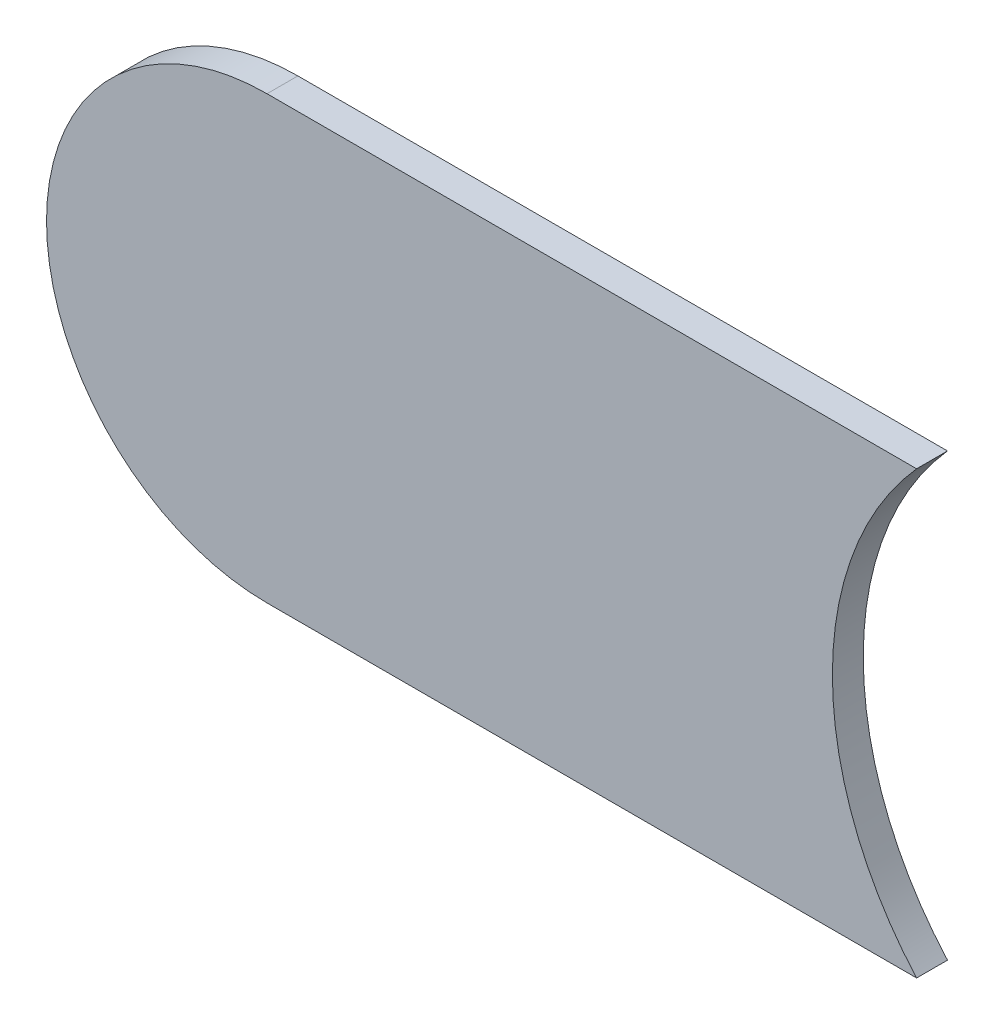
ISO-10303-21;
HEADER;
FILE_DESCRIPTION(('STEP AP214'),'2;1');
FILE_NAME('part.step','',(''),(''),'','','');
FILE_SCHEMA(('AUTOMOTIVE_DESIGN { 1 0 10303 214 1 1 1 1 }'));
ENDSEC;
DATA;
#1=APPLICATION_CONTEXT('core data for automotive mechanical design processes');
#2=APPLICATION_PROTOCOL_DEFINITION('international standard','automotive_design',2000,#1);
#3=PRODUCT_CONTEXT('',#1,'mechanical');
#4=PRODUCT('Part','Part','',(#3));
#5=PRODUCT_RELATED_PRODUCT_CATEGORY('part','',(#4));
#6=PRODUCT_DEFINITION_FORMATION('','',#4);
#7=PRODUCT_DEFINITION_CONTEXT('part definition',#1,'design');
#8=PRODUCT_DEFINITION('design','',#6,#7);
#9=PRODUCT_DEFINITION_SHAPE('','',#8);
#10=(LENGTH_UNIT() NAMED_UNIT(*) SI_UNIT(.MILLI.,.METRE.));
#11=(NAMED_UNIT(*) PLANE_ANGLE_UNIT() SI_UNIT($,.RADIAN.));
#12=(NAMED_UNIT(*) SI_UNIT($,.STERADIAN.) SOLID_ANGLE_UNIT());
#13=UNCERTAINTY_MEASURE_WITH_UNIT(LENGTH_MEASURE(1.E-05),#10,'distance_accuracy_value','');
#14=(GEOMETRIC_REPRESENTATION_CONTEXT(3) GLOBAL_UNCERTAINTY_ASSIGNED_CONTEXT((#13)) GLOBAL_UNIT_ASSIGNED_CONTEXT((#10,
#11,#12)) REPRESENTATION_CONTEXT('',''));
#15=CARTESIAN_POINT('',(0.,0.,0.));
#16=DIRECTION('',(0.,0.,1.));
#17=DIRECTION('',(1.,0.,0.));
#18=AXIS2_PLACEMENT_3D('',#15,#16,#17);
#19=CARTESIAN_POINT('',(154.432,-72.894,-0.035));
#20=DIRECTION('',(0.,1.,0.));
#21=DIRECTION('',(1.,0.,0.));
#22=AXIS2_PLACEMENT_3D('',#19,#20,#21);
#23=PLANE('',#22);
#24=DIRECTION('',(0.,0.,-1.));
#25=VECTOR('',#24,1.);
#26=CARTESIAN_POINT('',(155.16849150281,-72.894,-0.045));
#27=LINE('',#26,#25);
#28=CARTESIAN_POINT('',(155.16849150281,-72.894,0.));
#29=VERTEX_POINT('',#28);
#30=CARTESIAN_POINT('',(155.16849150281,-72.894,-0.035));
#31=VERTEX_POINT('',#30);
#32=EDGE_CURVE('E11',#29,#31,#27,.T.);
#33=ORIENTED_EDGE('',*,*,#32,.F.);
#34=DIRECTION('',(1.,0.,0.));
#35=VECTOR('',#34,1.);
#36=CARTESIAN_POINT('',(154.432,-72.894,0.));
#37=LINE('',#36,#35);
#38=CARTESIAN_POINT('',(154.432,-72.894,0.));
#39=VERTEX_POINT('',#38);
#40=EDGE_CURVE('E21',#39,#29,#37,.T.);
#41=ORIENTED_EDGE('',*,*,#40,.F.);
#42=DIRECTION('',(0.,0.,1.));
#43=VECTOR('',#42,1.);
#44=CARTESIAN_POINT('',(154.432,-72.894,-0.035));
#45=LINE('',#44,#43);
#46=CARTESIAN_POINT('',(154.432,-72.894,-0.035));
#47=VERTEX_POINT('',#46);
#48=EDGE_CURVE('E73',#47,#39,#45,.T.);
#49=ORIENTED_EDGE('',*,*,#48,.F.);
#50=DIRECTION('',(1.,0.,0.));
#51=VECTOR('',#50,1.);
#52=CARTESIAN_POINT('',(154.432,-72.894,-0.035));
#53=LINE('',#52,#51);
#54=EDGE_CURVE('E68',#47,#31,#53,.T.);
#55=ORIENTED_EDGE('',*,*,#54,.T.);
#56=EDGE_LOOP('',(#33,#41,#49,#55));
#57=FACE_BOUND('',#56,.T.);
#58=ADVANCED_FACE('F17',(#57),#23,.F.);
#59=CARTESIAN_POINT('',(155.448,-72.644,-0.045));
#60=DIRECTION('',(0.,0.,-1.));
#61=DIRECTION('',(0.,-1.,0.));
#62=AXIS2_PLACEMENT_3D('',#59,#60,#61);
#63=CYLINDRICAL_SURFACE('',#62,0.375);
#64=DIRECTION('',(0.,0.,-1.));
#65=VECTOR('',#64,1.);
#66=CARTESIAN_POINT('',(155.16849150281,-72.394,-0.045));
#67=LINE('',#66,#65);
#68=CARTESIAN_POINT('',(155.16849150282,-72.394,0.));
#69=VERTEX_POINT('',#68);
#70=CARTESIAN_POINT('',(155.16849150282,-72.394,-0.035));
#71=VERTEX_POINT('',#70);
#72=EDGE_CURVE('E86',#69,#71,#67,.T.);
#73=ORIENTED_EDGE('',*,*,#72,.F.);
#74=CARTESIAN_POINT('',(155.448,-72.644,0.));
#75=DIRECTION('',(0.,0.,-1.));
#76=DIRECTION('',(0.,-1.,0.));
#77=AXIS2_PLACEMENT_3D('',#74,#75,#76);
#78=CIRCLE('',#77,0.375);
#79=EDGE_CURVE('E63',#29,#69,#78,.T.);
#80=ORIENTED_EDGE('',*,*,#79,.F.);
#81=ORIENTED_EDGE('',*,*,#32,.T.);
#82=CARTESIAN_POINT('',(155.448,-72.644,-0.035));
#83=DIRECTION('',(0.,0.,-1.));
#84=DIRECTION('',(0.,-1.,0.));
#85=AXIS2_PLACEMENT_3D('',#82,#83,#84);
#86=CIRCLE('',#85,0.375);
#87=EDGE_CURVE('E61',#31,#71,#86,.T.);
#88=ORIENTED_EDGE('',*,*,#87,.T.);
#89=EDGE_LOOP('',(#73,#80,#81,#88));
#90=FACE_BOUND('',#89,.T.);
#91=ADVANCED_FACE('F19',(#90),#63,.F.);
#92=CARTESIAN_POINT('',(155.448,-72.394,0.));
#93=DIRECTION('',(0.,0.,1.));
#94=DIRECTION('',(1.,0.,0.));
#95=AXIS2_PLACEMENT_3D('',#92,#93,#94);
#96=PLANE('',#95);
#97=ORIENTED_EDGE('',*,*,#79,.T.);
#98=DIRECTION('',(-1.,0.,0.));
#99=VECTOR('',#98,1.);
#100=CARTESIAN_POINT('',(155.448,-72.394,0.));
#101=LINE('',#100,#99);
#102=CARTESIAN_POINT('',(154.432,-72.394,0.));
#103=VERTEX_POINT('',#102);
#104=EDGE_CURVE('E107',#69,#103,#101,.T.);
#105=ORIENTED_EDGE('',*,*,#104,.T.);
#106=CARTESIAN_POINT('',(154.432,-72.644,0.));
#107=DIRECTION('',(0.,0.,1.));
#108=DIRECTION('',(0.,1.,0.));
#109=AXIS2_PLACEMENT_3D('',#106,#107,#108);
#110=CIRCLE('',#109,0.25);
#111=EDGE_CURVE('E90',#103,#39,#110,.T.);
#112=ORIENTED_EDGE('',*,*,#111,.T.);
#113=ORIENTED_EDGE('',*,*,#40,.T.);
#114=EDGE_LOOP('',(#97,#105,#112,#113));
#115=FACE_BOUND('',#114,.T.);
#116=ADVANCED_FACE('F104',(#115),#96,.T.);
#117=CARTESIAN_POINT('',(154.432,-72.644,-0.035));
#118=DIRECTION('',(0.,0.,-1.));
#119=DIRECTION('',(0.,1.,0.));
#120=AXIS2_PLACEMENT_3D('',#117,#118,#119);
#121=CYLINDRICAL_SURFACE('',#120,0.25);
#122=CARTESIAN_POINT('',(154.432,-72.644,-0.035));
#123=DIRECTION('',(0.,0.,1.));
#124=DIRECTION('',(0.,1.,0.));
#125=AXIS2_PLACEMENT_3D('',#122,#123,#124);
#126=CIRCLE('',#125,0.25);
#127=CARTESIAN_POINT('',(154.432,-72.394,-0.035));
#128=VERTEX_POINT('',#127);
#129=EDGE_CURVE('E74',#128,#47,#126,.T.);
#130=ORIENTED_EDGE('',*,*,#129,.T.);
#131=ORIENTED_EDGE('',*,*,#48,.T.);
#132=ORIENTED_EDGE('',*,*,#111,.F.);
#133=DIRECTION('',(0.,0.,1.));
#134=VECTOR('',#133,1.);
#135=CARTESIAN_POINT('',(154.432,-72.394,-0.035));
#136=LINE('',#135,#134);
#137=EDGE_CURVE('E113',#128,#103,#136,.T.);
#138=ORIENTED_EDGE('',*,*,#137,.F.);
#139=EDGE_LOOP('',(#130,#131,#132,#138));
#140=FACE_BOUND('',#139,.T.);
#141=ADVANCED_FACE('F111',(#140),#121,.T.);
#142=CARTESIAN_POINT('',(155.448,-72.394,-0.035));
#143=DIRECTION('',(0.,0.,1.));
#144=DIRECTION('',(1.,0.,0.));
#145=AXIS2_PLACEMENT_3D('',#142,#143,#144);
#146=PLANE('',#145);
#147=ORIENTED_EDGE('',*,*,#54,.F.);
#148=ORIENTED_EDGE('',*,*,#129,.F.);
#149=DIRECTION('',(-1.,0.,0.));
#150=VECTOR('',#149,1.);
#151=CARTESIAN_POINT('',(155.448,-72.394,-0.035));
#152=LINE('',#151,#150);
#153=EDGE_CURVE('E70',#71,#128,#152,.T.);
#154=ORIENTED_EDGE('',*,*,#153,.F.);
#155=ORIENTED_EDGE('',*,*,#87,.F.);
#156=EDGE_LOOP('',(#147,#148,#154,#155));
#157=FACE_BOUND('',#156,.T.);
#158=ADVANCED_FACE('F66',(#157),#146,.F.);
#159=CARTESIAN_POINT('',(155.448,-72.394,-0.035));
#160=DIRECTION('',(0.,-1.,0.));
#161=DIRECTION('',(0.,0.,-1.));
#162=AXIS2_PLACEMENT_3D('',#159,#160,#161);
#163=PLANE('',#162);
#164=ORIENTED_EDGE('',*,*,#137,.T.);
#165=ORIENTED_EDGE('',*,*,#104,.F.);
#166=ORIENTED_EDGE('',*,*,#72,.T.);
#167=ORIENTED_EDGE('',*,*,#153,.T.);
#168=EDGE_LOOP('',(#164,#165,#166,#167));
#169=FACE_BOUND('',#168,.T.);
#170=ADVANCED_FACE('F116',(#169),#163,.F.);
#171=CLOSED_SHELL('',(#58,#91,#116,#141,#158,#170));
#172=MANIFOLD_SOLID_BREP('B1',#171);
#173=ADVANCED_BREP_SHAPE_REPRESENTATION('',(#18,#172),#14);
#174=SHAPE_DEFINITION_REPRESENTATION(#9,#173);
ENDSEC;
END-ISO-10303-21;
